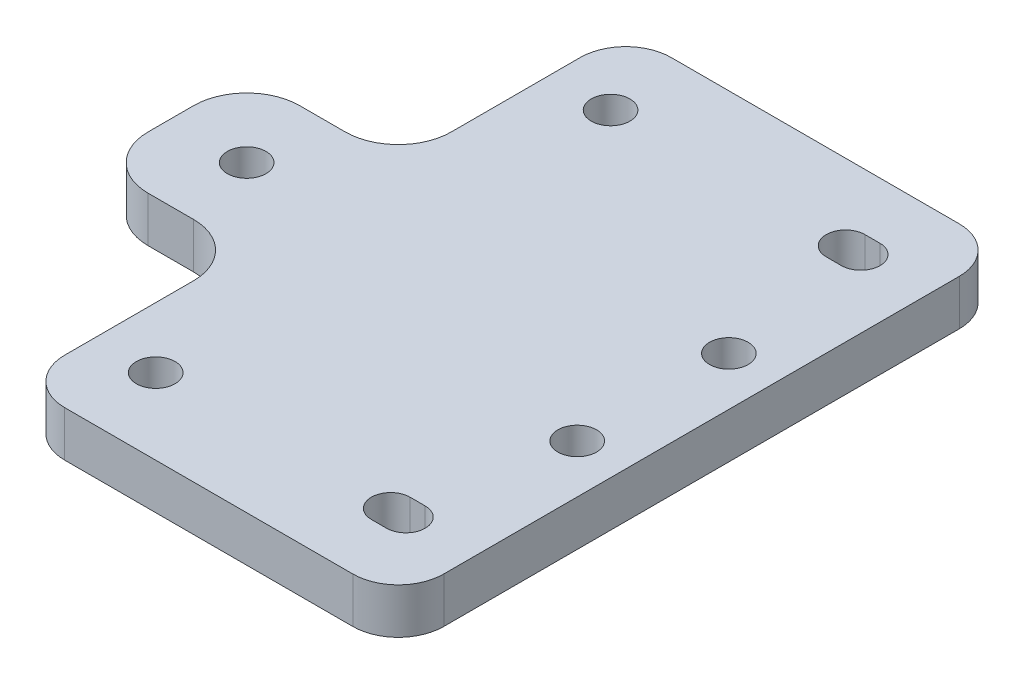
ISO-10303-21;
HEADER;
FILE_DESCRIPTION(('STEP AP214'),'2;1');
FILE_NAME('part.step','',(''),(''),'','','');
FILE_SCHEMA(('AUTOMOTIVE_DESIGN { 1 0 10303 214 1 1 1 1 }'));
ENDSEC;
DATA;
#1=APPLICATION_CONTEXT('core data for automotive mechanical design processes');
#2=APPLICATION_PROTOCOL_DEFINITION('international standard','automotive_design',2000,#1);
#3=PRODUCT_CONTEXT('',#1,'mechanical');
#4=PRODUCT('Part','Part','',(#3));
#5=PRODUCT_RELATED_PRODUCT_CATEGORY('part','',(#4));
#6=PRODUCT_DEFINITION_FORMATION('','',#4);
#7=PRODUCT_DEFINITION_CONTEXT('part definition',#1,'design');
#8=PRODUCT_DEFINITION('design','',#6,#7);
#9=PRODUCT_DEFINITION_SHAPE('','',#8);
#10=(LENGTH_UNIT() NAMED_UNIT(*) SI_UNIT(.MILLI.,.METRE.));
#11=(NAMED_UNIT(*) PLANE_ANGLE_UNIT() SI_UNIT($,.RADIAN.));
#12=(NAMED_UNIT(*) SI_UNIT($,.STERADIAN.) SOLID_ANGLE_UNIT());
#13=UNCERTAINTY_MEASURE_WITH_UNIT(LENGTH_MEASURE(1.E-05),#10,'distance_accuracy_value','');
#14=(GEOMETRIC_REPRESENTATION_CONTEXT(3) GLOBAL_UNCERTAINTY_ASSIGNED_CONTEXT((#13)) GLOBAL_UNIT_ASSIGNED_CONTEXT((#10,
#11,#12)) REPRESENTATION_CONTEXT('',''));
#15=CARTESIAN_POINT('',(0.,0.,0.));
#16=DIRECTION('',(0.,0.,1.));
#17=DIRECTION('',(1.,0.,0.));
#18=AXIS2_PLACEMENT_3D('',#15,#16,#17);
#19=CARTESIAN_POINT('',(19.,6.,-34.));
#20=DIRECTION('',(0.,-1.,0.));
#21=DIRECTION('',(0.,0.,-1.));
#22=AXIS2_PLACEMENT_3D('',#19,#20,#21);
#23=PLANE('',#22);
#24=CARTESIAN_POINT('',(-17.,6.,30.));
#25=DIRECTION('',(0.,-1.,0.));
#26=DIRECTION('',(0.,0.,1.));
#27=AXIS2_PLACEMENT_3D('',#24,#25,#26);
#28=CIRCLE('',#27,2.55);
#29=CARTESIAN_POINT('',(-17.,6.,32.55));
#30=VERTEX_POINT('',#29);
#31=EDGE_CURVE('E250',#30,#30,#28,.T.);
#32=ORIENTED_EDGE('',*,*,#31,.T.);
#33=EDGE_LOOP('',(#32));
#34=FACE_BOUND('',#33,.T.);
#35=DIRECTION('',(1.,0.,0.));
#36=VECTOR('',#35,1.);
#37=CARTESIAN_POINT('',(16.,6.,27.45));
#38=LINE('',#37,#36);
#39=CARTESIAN_POINT('',(14.,6.,27.45));
#40=VERTEX_POINT('',#39);
#41=CARTESIAN_POINT('',(16.,6.,27.45));
#42=VERTEX_POINT('',#41);
#43=EDGE_CURVE('E243',#40,#42,#38,.T.);
#44=ORIENTED_EDGE('',*,*,#43,.T.);
#45=CARTESIAN_POINT('',(16.,6.,30.));
#46=DIRECTION('',(0.,-1.,0.));
#47=DIRECTION('',(0.,0.,1.));
#48=AXIS2_PLACEMENT_3D('',#45,#46,#47);
#49=CIRCLE('',#48,2.55000000000001);
#50=CARTESIAN_POINT('',(16.,6.,32.55));
#51=VERTEX_POINT('',#50);
#52=EDGE_CURVE('E235',#42,#51,#49,.T.);
#53=ORIENTED_EDGE('',*,*,#52,.T.);
#54=DIRECTION('',(-1.,0.,0.));
#55=VECTOR('',#54,1.);
#56=CARTESIAN_POINT('',(16.,6.,32.55));
#57=LINE('',#56,#55);
#58=CARTESIAN_POINT('',(14.,6.,32.55));
#59=VERTEX_POINT('',#58);
#60=EDGE_CURVE('E238',#51,#59,#57,.T.);
#61=ORIENTED_EDGE('',*,*,#60,.T.);
#62=CARTESIAN_POINT('',(14.,6.,30.));
#63=DIRECTION('',(0.,-1.,0.));
#64=DIRECTION('',(0.,0.,1.));
#65=AXIS2_PLACEMENT_3D('',#62,#63,#64);
#66=CIRCLE('',#65,2.55000000000001);
#67=EDGE_CURVE('E48',#59,#40,#66,.T.);
#68=ORIENTED_EDGE('',*,*,#67,.T.);
#69=EDGE_LOOP('',(#44,#53,#61,#68));
#70=FACE_BOUND('',#69,.T.);
#71=DIRECTION('',(1.,0.,0.));
#72=VECTOR('',#71,1.);
#73=CARTESIAN_POINT('',(16.,6.,-32.55));
#74=LINE('',#73,#72);
#75=CARTESIAN_POINT('',(14.,6.,-32.55));
#76=VERTEX_POINT('',#75);
#77=CARTESIAN_POINT('',(16.,6.,-32.55));
#78=VERTEX_POINT('',#77);
#79=EDGE_CURVE('E206',#76,#78,#74,.T.);
#80=ORIENTED_EDGE('',*,*,#79,.T.);
#81=CARTESIAN_POINT('',(16.,6.,-30.));
#82=DIRECTION('',(0.,-1.,0.));
#83=DIRECTION('',(0.,0.,-1.));
#84=AXIS2_PLACEMENT_3D('',#81,#82,#83);
#85=CIRCLE('',#84,2.55000000000001);
#86=CARTESIAN_POINT('',(16.,6.,-27.45));
#87=VERTEX_POINT('',#86);
#88=EDGE_CURVE('E198',#78,#87,#85,.T.);
#89=ORIENTED_EDGE('',*,*,#88,.T.);
#90=DIRECTION('',(-1.,0.,0.));
#91=VECTOR('',#90,1.);
#92=CARTESIAN_POINT('',(16.,6.,-27.45));
#93=LINE('',#92,#91);
#94=CARTESIAN_POINT('',(14.,6.,-27.45));
#95=VERTEX_POINT('',#94);
#96=EDGE_CURVE('E209',#87,#95,#93,.T.);
#97=ORIENTED_EDGE('',*,*,#96,.T.);
#98=CARTESIAN_POINT('',(14.,6.,-30.));
#99=DIRECTION('',(0.,-1.,0.));
#100=DIRECTION('',(0.,0.,-1.));
#101=AXIS2_PLACEMENT_3D('',#98,#99,#100);
#102=CIRCLE('',#101,2.55000000000001);
#103=EDGE_CURVE('E56',#95,#76,#102,.T.);
#104=ORIENTED_EDGE('',*,*,#103,.T.);
#105=EDGE_LOOP('',(#80,#89,#97,#104));
#106=FACE_BOUND('',#105,.T.);
#107=CARTESIAN_POINT('',(-17.,6.,-30.));
#108=DIRECTION('',(0.,-1.,0.));
#109=DIRECTION('',(0.,0.,-1.));
#110=AXIS2_PLACEMENT_3D('',#107,#108,#109);
#111=CIRCLE('',#110,2.55);
#112=CARTESIAN_POINT('',(-17.,6.,-32.55));
#113=VERTEX_POINT('',#112);
#114=EDGE_CURVE('E270',#113,#113,#111,.T.);
#115=ORIENTED_EDGE('',*,*,#114,.T.);
#116=EDGE_LOOP('',(#115));
#117=FACE_BOUND('',#116,.T.);
#118=CARTESIAN_POINT('',(19.,6.,-34.));
#119=DIRECTION('',(0.,1.,0.));
#120=DIRECTION('',(0.,0.,-1.));
#121=AXIS2_PLACEMENT_3D('',#118,#119,#120);
#122=CIRCLE('',#121,6.);
#123=CARTESIAN_POINT('',(25.,6.,-34.));
#124=VERTEX_POINT('',#123);
#125=CARTESIAN_POINT('',(19.,6.,-40.));
#126=VERTEX_POINT('',#125);
#127=EDGE_CURVE('E294',#124,#126,#122,.T.);
#128=ORIENTED_EDGE('',*,*,#127,.T.);
#129=DIRECTION('',(-1.,0.,0.));
#130=VECTOR('',#129,1.);
#131=CARTESIAN_POINT('',(-19.,6.,-40.));
#132=LINE('',#131,#130);
#133=CARTESIAN_POINT('',(-19.,6.,-40.));
#134=VERTEX_POINT('',#133);
#135=EDGE_CURVE('E297',#126,#134,#132,.T.);
#136=ORIENTED_EDGE('',*,*,#135,.T.);
#137=CARTESIAN_POINT('',(-19.,6.,-34.));
#138=DIRECTION('',(0.,1.,0.));
#139=DIRECTION('',(0.,0.,-1.));
#140=AXIS2_PLACEMENT_3D('',#137,#138,#139);
#141=CIRCLE('',#140,6.);
#142=CARTESIAN_POINT('',(-25.,6.,-34.));
#143=VERTEX_POINT('',#142);
#144=EDGE_CURVE('E300',#134,#143,#141,.T.);
#145=ORIENTED_EDGE('',*,*,#144,.T.);
#146=DIRECTION('',(0.,0.,1.));
#147=VECTOR('',#146,1.);
#148=CARTESIAN_POINT('',(-25.,6.,-17.));
#149=LINE('',#148,#147);
#150=CARTESIAN_POINT('',(-25.,6.,-17.));
#151=VERTEX_POINT('',#150);
#152=EDGE_CURVE('E302',#143,#151,#149,.T.);
#153=ORIENTED_EDGE('',*,*,#152,.T.);
#154=CARTESIAN_POINT('',(-32.,6.,-17.));
#155=DIRECTION('',(0.,-1.,0.));
#156=DIRECTION('',(0.,0.,1.));
#157=AXIS2_PLACEMENT_3D('',#154,#155,#156);
#158=CIRCLE('',#157,7.);
#159=CARTESIAN_POINT('',(-32.,6.,-10.));
#160=VERTEX_POINT('',#159);
#161=EDGE_CURVE('E304',#151,#160,#158,.T.);
#162=ORIENTED_EDGE('',*,*,#161,.T.);
#163=DIRECTION('',(-1.,0.,0.));
#164=VECTOR('',#163,1.);
#165=CARTESIAN_POINT('',(-32.,6.,-10.));
#166=LINE('',#165,#164);
#167=CARTESIAN_POINT('',(-38.,6.,-10.));
#168=VERTEX_POINT('',#167);
#169=EDGE_CURVE('E306',#160,#168,#166,.T.);
#170=ORIENTED_EDGE('',*,*,#169,.T.);
#171=CARTESIAN_POINT('',(-38.,6.,-3.));
#172=DIRECTION('',(0.,1.,0.));
#173=DIRECTION('',(0.,0.,-1.));
#174=AXIS2_PLACEMENT_3D('',#171,#172,#173);
#175=CIRCLE('',#174,7.);
#176=CARTESIAN_POINT('',(-45.,6.,-3.));
#177=VERTEX_POINT('',#176);
#178=EDGE_CURVE('E308',#168,#177,#175,.T.);
#179=ORIENTED_EDGE('',*,*,#178,.T.);
#180=DIRECTION('',(0.,0.,1.));
#181=VECTOR('',#180,1.);
#182=CARTESIAN_POINT('',(-45.,6.,3.));
#183=LINE('',#182,#181);
#184=CARTESIAN_POINT('',(-45.,6.,3.));
#185=VERTEX_POINT('',#184);
#186=EDGE_CURVE('E310',#177,#185,#183,.T.);
#187=ORIENTED_EDGE('',*,*,#186,.T.);
#188=CARTESIAN_POINT('',(-38.,6.,3.));
#189=DIRECTION('',(0.,1.,0.));
#190=DIRECTION('',(0.,0.,-1.));
#191=AXIS2_PLACEMENT_3D('',#188,#189,#190);
#192=CIRCLE('',#191,7.);
#193=CARTESIAN_POINT('',(-38.,6.,10.));
#194=VERTEX_POINT('',#193);
#195=EDGE_CURVE('E312',#185,#194,#192,.T.);
#196=ORIENTED_EDGE('',*,*,#195,.T.);
#197=DIRECTION('',(1.,0.,0.));
#198=VECTOR('',#197,1.);
#199=CARTESIAN_POINT('',(-32.,6.,10.));
#200=LINE('',#199,#198);
#201=CARTESIAN_POINT('',(-32.,6.,10.));
#202=VERTEX_POINT('',#201);
#203=EDGE_CURVE('E314',#194,#202,#200,.T.);
#204=ORIENTED_EDGE('',*,*,#203,.T.);
#205=CARTESIAN_POINT('',(-32.,6.,17.));
#206=DIRECTION('',(0.,-1.,0.));
#207=DIRECTION('',(0.,0.,1.));
#208=AXIS2_PLACEMENT_3D('',#205,#206,#207);
#209=CIRCLE('',#208,7.);
#210=CARTESIAN_POINT('',(-25.,6.,17.));
#211=VERTEX_POINT('',#210);
#212=EDGE_CURVE('E316',#202,#211,#209,.T.);
#213=ORIENTED_EDGE('',*,*,#212,.T.);
#214=DIRECTION('',(0.,0.,1.));
#215=VECTOR('',#214,1.);
#216=CARTESIAN_POINT('',(-25.,6.,34.));
#217=LINE('',#216,#215);
#218=CARTESIAN_POINT('',(-25.,6.,34.));
#219=VERTEX_POINT('',#218);
#220=EDGE_CURVE('E318',#211,#219,#217,.T.);
#221=ORIENTED_EDGE('',*,*,#220,.T.);
#222=CARTESIAN_POINT('',(-19.,6.,34.));
#223=DIRECTION('',(0.,1.,0.));
#224=DIRECTION('',(0.,0.,-1.));
#225=AXIS2_PLACEMENT_3D('',#222,#223,#224);
#226=CIRCLE('',#225,6.);
#227=CARTESIAN_POINT('',(-19.,6.,40.));
#228=VERTEX_POINT('',#227);
#229=EDGE_CURVE('E320',#219,#228,#226,.T.);
#230=ORIENTED_EDGE('',*,*,#229,.T.);
#231=DIRECTION('',(1.,0.,0.));
#232=VECTOR('',#231,1.);
#233=CARTESIAN_POINT('',(-19.,6.,40.));
#234=LINE('',#233,#232);
#235=CARTESIAN_POINT('',(19.,6.,40.));
#236=VERTEX_POINT('',#235);
#237=EDGE_CURVE('E322',#228,#236,#234,.T.);
#238=ORIENTED_EDGE('',*,*,#237,.T.);
#239=CARTESIAN_POINT('',(19.,6.,34.));
#240=DIRECTION('',(0.,1.,0.));
#241=DIRECTION('',(0.,0.,1.));
#242=AXIS2_PLACEMENT_3D('',#239,#240,#241);
#243=CIRCLE('',#242,6.);
#244=CARTESIAN_POINT('',(25.,6.,34.));
#245=VERTEX_POINT('',#244);
#246=EDGE_CURVE('E324',#236,#245,#243,.T.);
#247=ORIENTED_EDGE('',*,*,#246,.T.);
#248=DIRECTION('',(0.,0.,-1.));
#249=VECTOR('',#248,1.);
#250=CARTESIAN_POINT('',(25.,6.,34.));
#251=LINE('',#250,#249);
#252=EDGE_CURVE('E326',#245,#124,#251,.T.);
#253=ORIENTED_EDGE('',*,*,#252,.T.);
#254=EDGE_LOOP('',(#128,#136,#145,#153,#162,#170,#179,#187,#196,#204,#213,#221,#230,#238,#247,#253));
#255=FACE_BOUND('',#254,.T.);
#256=CARTESIAN_POINT('',(18.6050000000063,6.,-9.99999999999283));
#257=DIRECTION('',(0.,1.,0.));
#258=DIRECTION('',(0.,0.,1.));
#259=AXIS2_PLACEMENT_3D('',#256,#257,#258);
#260=CIRCLE('',#259,2.55);
#261=CARTESIAN_POINT('',(18.6050000000063,6.,-7.44999999999283));
#262=VERTEX_POINT('',#261);
#263=EDGE_CURVE('E288',#262,#262,#260,.T.);
#264=ORIENTED_EDGE('',*,*,#263,.F.);
#265=EDGE_LOOP('',(#264));
#266=FACE_BOUND('',#265,.T.);
#267=CARTESIAN_POINT('',(-35.,6.,0.));
#268=DIRECTION('',(0.,1.,0.));
#269=DIRECTION('',(0.,0.,1.));
#270=AXIS2_PLACEMENT_3D('',#267,#268,#269);
#271=CIRCLE('',#270,2.55000000000001);
#272=CARTESIAN_POINT('',(-35.,6.,2.55000000000001));
#273=VERTEX_POINT('',#272);
#274=EDGE_CURVE('E282',#273,#273,#271,.T.);
#275=ORIENTED_EDGE('',*,*,#274,.F.);
#276=EDGE_LOOP('',(#275));
#277=FACE_BOUND('',#276,.T.);
#278=CARTESIAN_POINT('',(18.6050000000063,6.,9.9999999999928));
#279=DIRECTION('',(0.,1.,0.));
#280=DIRECTION('',(0.,0.,-1.));
#281=AXIS2_PLACEMENT_3D('',#278,#279,#280);
#282=CIRCLE('',#281,2.55);
#283=CARTESIAN_POINT('',(18.6050000000063,6.,7.4499999999928));
#284=VERTEX_POINT('',#283);
#285=EDGE_CURVE('E276',#284,#284,#282,.T.);
#286=ORIENTED_EDGE('',*,*,#285,.F.);
#287=EDGE_LOOP('',(#286));
#288=FACE_BOUND('',#287,.T.);
#289=ADVANCED_FACE('F33',(#34,#70,#106,#117,#255,#266,#277,#288),#23,.F.);
#290=CARTESIAN_POINT('',(19.,0.,-34.));
#291=DIRECTION('',(0.,-1.,0.));
#292=DIRECTION('',(0.,0.,-1.));
#293=AXIS2_PLACEMENT_3D('',#290,#291,#292);
#294=PLANE('',#293);
#295=CARTESIAN_POINT('',(-17.,0.,30.));
#296=DIRECTION('',(0.,-1.,0.));
#297=DIRECTION('',(0.,0.,1.));
#298=AXIS2_PLACEMENT_3D('',#295,#296,#297);
#299=CIRCLE('',#298,2.55);
#300=CARTESIAN_POINT('',(-17.,0.,32.55));
#301=VERTEX_POINT('',#300);
#302=EDGE_CURVE('E267',#301,#301,#299,.T.);
#303=ORIENTED_EDGE('',*,*,#302,.F.);
#304=EDGE_LOOP('',(#303));
#305=FACE_BOUND('',#304,.T.);
#306=CARTESIAN_POINT('',(16.,0.,30.));
#307=DIRECTION('',(0.,-1.,0.));
#308=DIRECTION('',(0.,0.,1.));
#309=AXIS2_PLACEMENT_3D('',#306,#307,#308);
#310=CIRCLE('',#309,2.55000000000001);
#311=CARTESIAN_POINT('',(16.,0.,27.45));
#312=VERTEX_POINT('',#311);
#313=CARTESIAN_POINT('',(16.,0.,32.55));
#314=VERTEX_POINT('',#313);
#315=EDGE_CURVE('E247',#312,#314,#310,.T.);
#316=ORIENTED_EDGE('',*,*,#315,.F.);
#317=DIRECTION('',(1.,0.,0.));
#318=VECTOR('',#317,1.);
#319=CARTESIAN_POINT('',(16.,0.,27.45));
#320=LINE('',#319,#318);
#321=CARTESIAN_POINT('',(14.,0.,27.45));
#322=VERTEX_POINT('',#321);
#323=EDGE_CURVE('E239',#322,#312,#320,.T.);
#324=ORIENTED_EDGE('',*,*,#323,.F.);
#325=CARTESIAN_POINT('',(14.,0.,30.));
#326=DIRECTION('',(0.,-1.,0.));
#327=DIRECTION('',(0.,0.,1.));
#328=AXIS2_PLACEMENT_3D('',#325,#326,#327);
#329=CIRCLE('',#328,2.55000000000001);
#330=CARTESIAN_POINT('',(14.,0.,32.55));
#331=VERTEX_POINT('',#330);
#332=EDGE_CURVE('E253',#331,#322,#329,.T.);
#333=ORIENTED_EDGE('',*,*,#332,.F.);
#334=DIRECTION('',(-1.,0.,0.));
#335=VECTOR('',#334,1.);
#336=CARTESIAN_POINT('',(16.,0.,32.55));
#337=LINE('',#336,#335);
#338=EDGE_CURVE('E249',#314,#331,#337,.T.);
#339=ORIENTED_EDGE('',*,*,#338,.F.);
#340=EDGE_LOOP('',(#316,#324,#333,#339));
#341=FACE_BOUND('',#340,.T.);
#342=CARTESIAN_POINT('',(16.,0.,-30.));
#343=DIRECTION('',(0.,-1.,0.));
#344=DIRECTION('',(0.,0.,-1.));
#345=AXIS2_PLACEMENT_3D('',#342,#343,#344);
#346=CIRCLE('',#345,2.55000000000001);
#347=CARTESIAN_POINT('',(16.,0.,-32.55));
#348=VERTEX_POINT('',#347);
#349=CARTESIAN_POINT('',(16.,0.,-27.45));
#350=VERTEX_POINT('',#349);
#351=EDGE_CURVE('E201',#348,#350,#346,.T.);
#352=ORIENTED_EDGE('',*,*,#351,.F.);
#353=DIRECTION('',(1.,0.,0.));
#354=VECTOR('',#353,1.);
#355=CARTESIAN_POINT('',(16.,0.,-32.55));
#356=LINE('',#355,#354);
#357=CARTESIAN_POINT('',(14.,0.,-32.55));
#358=VERTEX_POINT('',#357);
#359=EDGE_CURVE('E215',#358,#348,#356,.T.);
#360=ORIENTED_EDGE('',*,*,#359,.F.);
#361=CARTESIAN_POINT('',(14.,0.,-30.));
#362=DIRECTION('',(0.,-1.,0.));
#363=DIRECTION('',(0.,0.,-1.));
#364=AXIS2_PLACEMENT_3D('',#361,#362,#363);
#365=CIRCLE('',#364,2.55000000000001);
#366=CARTESIAN_POINT('',(14.,0.,-27.45));
#367=VERTEX_POINT('',#366);
#368=EDGE_CURVE('E218',#367,#358,#365,.T.);
#369=ORIENTED_EDGE('',*,*,#368,.F.);
#370=DIRECTION('',(-1.,0.,0.));
#371=VECTOR('',#370,1.);
#372=CARTESIAN_POINT('',(16.,0.,-27.45));
#373=LINE('',#372,#371);
#374=EDGE_CURVE('E224',#350,#367,#373,.T.);
#375=ORIENTED_EDGE('',*,*,#374,.F.);
#376=EDGE_LOOP('',(#352,#360,#369,#375));
#377=FACE_BOUND('',#376,.T.);
#378=CARTESIAN_POINT('',(-17.,0.,-30.));
#379=DIRECTION('',(0.,-1.,0.));
#380=DIRECTION('',(0.,0.,-1.));
#381=AXIS2_PLACEMENT_3D('',#378,#379,#380);
#382=CIRCLE('',#381,2.55);
#383=CARTESIAN_POINT('',(-17.,0.,-32.55));
#384=VERTEX_POINT('',#383);
#385=EDGE_CURVE('E231',#384,#384,#382,.T.);
#386=ORIENTED_EDGE('',*,*,#385,.F.);
#387=EDGE_LOOP('',(#386));
#388=FACE_BOUND('',#387,.T.);
#389=CARTESIAN_POINT('',(-35.,0.,0.));
#390=DIRECTION('',(0.,1.,0.));
#391=DIRECTION('',(0.,0.,1.));
#392=AXIS2_PLACEMENT_3D('',#389,#390,#391);
#393=CIRCLE('',#392,2.55000000000001);
#394=CARTESIAN_POINT('',(-35.,0.,2.55000000000001));
#395=VERTEX_POINT('',#394);
#396=EDGE_CURVE('E279',#395,#395,#393,.T.);
#397=ORIENTED_EDGE('',*,*,#396,.T.);
#398=EDGE_LOOP('',(#397));
#399=FACE_BOUND('',#398,.T.);
#400=CARTESIAN_POINT('',(19.,0.,-34.));
#401=DIRECTION('',(0.,1.,0.));
#402=DIRECTION('',(0.,0.,-1.));
#403=AXIS2_PLACEMENT_3D('',#400,#401,#402);
#404=CIRCLE('',#403,6.);
#405=CARTESIAN_POINT('',(25.,0.,-34.));
#406=VERTEX_POINT('',#405);
#407=CARTESIAN_POINT('',(19.,0.,-40.));
#408=VERTEX_POINT('',#407);
#409=EDGE_CURVE('E291',#406,#408,#404,.T.);
#410=ORIENTED_EDGE('',*,*,#409,.F.);
#411=DIRECTION('',(0.,0.,-1.));
#412=VECTOR('',#411,1.);
#413=CARTESIAN_POINT('',(25.,0.,34.));
#414=LINE('',#413,#412);
#415=CARTESIAN_POINT('',(25.,0.,34.));
#416=VERTEX_POINT('',#415);
#417=EDGE_CURVE('E298',#416,#406,#414,.T.);
#418=ORIENTED_EDGE('',*,*,#417,.F.);
#419=CARTESIAN_POINT('',(19.,0.,34.));
#420=DIRECTION('',(0.,1.,0.));
#421=DIRECTION('',(0.,0.,1.));
#422=AXIS2_PLACEMENT_3D('',#419,#420,#421);
#423=CIRCLE('',#422,6.);
#424=CARTESIAN_POINT('',(19.,0.,40.));
#425=VERTEX_POINT('',#424);
#426=EDGE_CURVE('E357',#425,#416,#423,.T.);
#427=ORIENTED_EDGE('',*,*,#426,.F.);
#428=DIRECTION('',(1.,0.,0.));
#429=VECTOR('',#428,1.);
#430=CARTESIAN_POINT('',(-19.,0.,40.));
#431=LINE('',#430,#429);
#432=CARTESIAN_POINT('',(-19.,0.,40.));
#433=VERTEX_POINT('',#432);
#434=EDGE_CURVE('E355',#433,#425,#431,.T.);
#435=ORIENTED_EDGE('',*,*,#434,.F.);
#436=CARTESIAN_POINT('',(-19.,0.,34.));
#437=DIRECTION('',(0.,1.,0.));
#438=DIRECTION('',(0.,0.,-1.));
#439=AXIS2_PLACEMENT_3D('',#436,#437,#438);
#440=CIRCLE('',#439,6.);
#441=CARTESIAN_POINT('',(-25.,0.,34.));
#442=VERTEX_POINT('',#441);
#443=EDGE_CURVE('E353',#442,#433,#440,.T.);
#444=ORIENTED_EDGE('',*,*,#443,.F.);
#445=DIRECTION('',(0.,0.,1.));
#446=VECTOR('',#445,1.);
#447=CARTESIAN_POINT('',(-25.,0.,34.));
#448=LINE('',#447,#446);
#449=CARTESIAN_POINT('',(-25.,0.,17.));
#450=VERTEX_POINT('',#449);
#451=EDGE_CURVE('E351',#450,#442,#448,.T.);
#452=ORIENTED_EDGE('',*,*,#451,.F.);
#453=CARTESIAN_POINT('',(-32.,0.,17.));
#454=DIRECTION('',(0.,-1.,0.));
#455=DIRECTION('',(0.,0.,1.));
#456=AXIS2_PLACEMENT_3D('',#453,#454,#455);
#457=CIRCLE('',#456,7.);
#458=CARTESIAN_POINT('',(-32.,0.,10.));
#459=VERTEX_POINT('',#458);
#460=EDGE_CURVE('E349',#459,#450,#457,.T.);
#461=ORIENTED_EDGE('',*,*,#460,.F.);
#462=DIRECTION('',(1.,0.,0.));
#463=VECTOR('',#462,1.);
#464=CARTESIAN_POINT('',(-32.,0.,10.));
#465=LINE('',#464,#463);
#466=CARTESIAN_POINT('',(-38.,0.,10.));
#467=VERTEX_POINT('',#466);
#468=EDGE_CURVE('E347',#467,#459,#465,.T.);
#469=ORIENTED_EDGE('',*,*,#468,.F.);
#470=CARTESIAN_POINT('',(-38.,0.,3.));
#471=DIRECTION('',(0.,1.,0.));
#472=DIRECTION('',(0.,0.,-1.));
#473=AXIS2_PLACEMENT_3D('',#470,#471,#472);
#474=CIRCLE('',#473,7.);
#475=CARTESIAN_POINT('',(-45.,0.,3.));
#476=VERTEX_POINT('',#475);
#477=EDGE_CURVE('E345',#476,#467,#474,.T.);
#478=ORIENTED_EDGE('',*,*,#477,.F.);
#479=DIRECTION('',(0.,0.,1.));
#480=VECTOR('',#479,1.);
#481=CARTESIAN_POINT('',(-45.,0.,3.));
#482=LINE('',#481,#480);
#483=CARTESIAN_POINT('',(-45.,0.,-3.));
#484=VERTEX_POINT('',#483);
#485=EDGE_CURVE('E343',#484,#476,#482,.T.);
#486=ORIENTED_EDGE('',*,*,#485,.F.);
#487=CARTESIAN_POINT('',(-38.,0.,-3.));
#488=DIRECTION('',(0.,1.,0.));
#489=DIRECTION('',(0.,0.,-1.));
#490=AXIS2_PLACEMENT_3D('',#487,#488,#489);
#491=CIRCLE('',#490,7.);
#492=CARTESIAN_POINT('',(-38.,0.,-10.));
#493=VERTEX_POINT('',#492);
#494=EDGE_CURVE('E341',#493,#484,#491,.T.);
#495=ORIENTED_EDGE('',*,*,#494,.F.);
#496=DIRECTION('',(-1.,0.,0.));
#497=VECTOR('',#496,1.);
#498=CARTESIAN_POINT('',(-32.,0.,-10.));
#499=LINE('',#498,#497);
#500=CARTESIAN_POINT('',(-32.,0.,-10.));
#501=VERTEX_POINT('',#500);
#502=EDGE_CURVE('E339',#501,#493,#499,.T.);
#503=ORIENTED_EDGE('',*,*,#502,.F.);
#504=CARTESIAN_POINT('',(-32.,0.,-17.));
#505=DIRECTION('',(0.,-1.,0.));
#506=DIRECTION('',(0.,0.,1.));
#507=AXIS2_PLACEMENT_3D('',#504,#505,#506);
#508=CIRCLE('',#507,7.);
#509=CARTESIAN_POINT('',(-25.,0.,-17.));
#510=VERTEX_POINT('',#509);
#511=EDGE_CURVE('E337',#510,#501,#508,.T.);
#512=ORIENTED_EDGE('',*,*,#511,.F.);
#513=DIRECTION('',(0.,0.,1.));
#514=VECTOR('',#513,1.);
#515=CARTESIAN_POINT('',(-25.,0.,-17.));
#516=LINE('',#515,#514);
#517=CARTESIAN_POINT('',(-25.,0.,-34.));
#518=VERTEX_POINT('',#517);
#519=EDGE_CURVE('E335',#518,#510,#516,.T.);
#520=ORIENTED_EDGE('',*,*,#519,.F.);
#521=CARTESIAN_POINT('',(-19.,0.,-34.));
#522=DIRECTION('',(0.,1.,0.));
#523=DIRECTION('',(0.,0.,-1.));
#524=AXIS2_PLACEMENT_3D('',#521,#522,#523);
#525=CIRCLE('',#524,6.);
#526=CARTESIAN_POINT('',(-19.,0.,-40.));
#527=VERTEX_POINT('',#526);
#528=EDGE_CURVE('E333',#527,#518,#525,.T.);
#529=ORIENTED_EDGE('',*,*,#528,.F.);
#530=DIRECTION('',(-1.,0.,0.));
#531=VECTOR('',#530,1.);
#532=CARTESIAN_POINT('',(-19.,0.,-40.));
#533=LINE('',#532,#531);
#534=EDGE_CURVE('E331',#408,#527,#533,.T.);
#535=ORIENTED_EDGE('',*,*,#534,.F.);
#536=EDGE_LOOP('',(#410,#418,#427,#435,#444,#452,#461,#469,#478,#486,#495,#503,#512,#520,#529,#535));
#537=FACE_BOUND('',#536,.T.);
#538=CARTESIAN_POINT('',(18.6050000000063,0.,-9.99999999999283));
#539=DIRECTION('',(0.,1.,0.));
#540=DIRECTION('',(0.,0.,1.));
#541=AXIS2_PLACEMENT_3D('',#538,#539,#540);
#542=CIRCLE('',#541,2.55);
#543=CARTESIAN_POINT('',(18.6050000000063,0.,-7.44999999999283));
#544=VERTEX_POINT('',#543);
#545=EDGE_CURVE('E285',#544,#544,#542,.T.);
#546=ORIENTED_EDGE('',*,*,#545,.T.);
#547=EDGE_LOOP('',(#546));
#548=FACE_BOUND('',#547,.T.);
#549=CARTESIAN_POINT('',(18.6050000000063,0.,9.9999999999928));
#550=DIRECTION('',(0.,1.,0.));
#551=DIRECTION('',(0.,0.,-1.));
#552=AXIS2_PLACEMENT_3D('',#549,#550,#551);
#553=CIRCLE('',#552,2.55);
#554=CARTESIAN_POINT('',(18.6050000000063,0.,7.4499999999928));
#555=VERTEX_POINT('',#554);
#556=EDGE_CURVE('E273',#555,#555,#553,.T.);
#557=ORIENTED_EDGE('',*,*,#556,.T.);
#558=EDGE_LOOP('',(#557));
#559=FACE_BOUND('',#558,.T.);
#560=ADVANCED_FACE('F411',(#305,#341,#377,#388,#399,#537,#548,#559),#294,.T.);
#561=CARTESIAN_POINT('',(19.,6.,-34.));
#562=DIRECTION('',(0.,-1.,0.));
#563=DIRECTION('',(0.,0.,-1.));
#564=AXIS2_PLACEMENT_3D('',#561,#562,#563);
#565=CYLINDRICAL_SURFACE('',#564,6.);
#566=ORIENTED_EDGE('',*,*,#409,.T.);
#567=DIRECTION('',(0.,-1.,0.));
#568=VECTOR('',#567,1.);
#569=CARTESIAN_POINT('',(19.,6.,-40.));
#570=LINE('',#569,#568);
#571=EDGE_CURVE('E11',#126,#408,#570,.T.);
#572=ORIENTED_EDGE('',*,*,#571,.F.);
#573=ORIENTED_EDGE('',*,*,#127,.F.);
#574=DIRECTION('',(0.,-1.,0.));
#575=VECTOR('',#574,1.);
#576=CARTESIAN_POINT('',(25.,6.,-34.));
#577=LINE('',#576,#575);
#578=EDGE_CURVE('E328',#124,#406,#577,.T.);
#579=ORIENTED_EDGE('',*,*,#578,.T.);
#580=EDGE_LOOP('',(#566,#572,#573,#579));
#581=FACE_BOUND('',#580,.T.);
#582=ADVANCED_FACE('F35',(#581),#565,.T.);
#583=CARTESIAN_POINT('',(-19.,6.,-40.));
#584=DIRECTION('',(0.,0.,1.));
#585=DIRECTION('',(1.,0.,0.));
#586=AXIS2_PLACEMENT_3D('',#583,#584,#585);
#587=PLANE('',#586);
#588=ORIENTED_EDGE('',*,*,#534,.T.);
#589=DIRECTION('',(0.,-1.,0.));
#590=VECTOR('',#589,1.);
#591=CARTESIAN_POINT('',(-19.,6.,-40.));
#592=LINE('',#591,#590);
#593=EDGE_CURVE('E41',#134,#527,#592,.T.);
#594=ORIENTED_EDGE('',*,*,#593,.F.);
#595=ORIENTED_EDGE('',*,*,#135,.F.);
#596=ORIENTED_EDGE('',*,*,#571,.T.);
#597=EDGE_LOOP('',(#588,#594,#595,#596));
#598=FACE_BOUND('',#597,.T.);
#599=ADVANCED_FACE('F429',(#598),#587,.F.);
#600=CARTESIAN_POINT('',(-19.,6.,-34.));
#601=DIRECTION('',(0.,-1.,0.));
#602=DIRECTION('',(0.,0.,-1.));
#603=AXIS2_PLACEMENT_3D('',#600,#601,#602);
#604=CYLINDRICAL_SURFACE('',#603,6.);
#605=ORIENTED_EDGE('',*,*,#528,.T.);
#606=DIRECTION('',(0.,-1.,0.));
#607=VECTOR('',#606,1.);
#608=CARTESIAN_POINT('',(-25.,6.,-34.));
#609=LINE('',#608,#607);
#610=EDGE_CURVE('E398',#143,#518,#609,.T.);
#611=ORIENTED_EDGE('',*,*,#610,.F.);
#612=ORIENTED_EDGE('',*,*,#144,.F.);
#613=ORIENTED_EDGE('',*,*,#593,.T.);
#614=EDGE_LOOP('',(#605,#611,#612,#613));
#615=FACE_BOUND('',#614,.T.);
#616=ADVANCED_FACE('F405',(#615),#604,.T.);
#617=CARTESIAN_POINT('',(-25.,6.,-17.));
#618=DIRECTION('',(1.,0.,0.));
#619=DIRECTION('',(0.,0.,-1.));
#620=AXIS2_PLACEMENT_3D('',#617,#618,#619);
#621=PLANE('',#620);
#622=ORIENTED_EDGE('',*,*,#519,.T.);
#623=DIRECTION('',(0.,-1.,0.));
#624=VECTOR('',#623,1.);
#625=CARTESIAN_POINT('',(-25.,6.,-17.));
#626=LINE('',#625,#624);
#627=EDGE_CURVE('E395',#151,#510,#626,.T.);
#628=ORIENTED_EDGE('',*,*,#627,.F.);
#629=ORIENTED_EDGE('',*,*,#152,.F.);
#630=ORIENTED_EDGE('',*,*,#610,.T.);
#631=EDGE_LOOP('',(#622,#628,#629,#630));
#632=FACE_BOUND('',#631,.T.);
#633=ADVANCED_FACE('F417',(#632),#621,.F.);
#634=CARTESIAN_POINT('',(-32.,6.,-17.));
#635=DIRECTION('',(0.,-1.,0.));
#636=DIRECTION('',(0.,0.,-1.));
#637=AXIS2_PLACEMENT_3D('',#634,#635,#636);
#638=CYLINDRICAL_SURFACE('',#637,7.);
#639=ORIENTED_EDGE('',*,*,#511,.T.);
#640=DIRECTION('',(0.,-1.,0.));
#641=VECTOR('',#640,1.);
#642=CARTESIAN_POINT('',(-32.,6.,-10.));
#643=LINE('',#642,#641);
#644=EDGE_CURVE('E392',#160,#501,#643,.T.);
#645=ORIENTED_EDGE('',*,*,#644,.F.);
#646=ORIENTED_EDGE('',*,*,#161,.F.);
#647=ORIENTED_EDGE('',*,*,#627,.T.);
#648=EDGE_LOOP('',(#639,#645,#646,#647));
#649=FACE_BOUND('',#648,.T.);
#650=ADVANCED_FACE('F421',(#649),#638,.F.);
#651=CARTESIAN_POINT('',(-32.,6.,-10.));
#652=DIRECTION('',(0.,0.,1.));
#653=DIRECTION('',(1.,0.,0.));
#654=AXIS2_PLACEMENT_3D('',#651,#652,#653);
#655=PLANE('',#654);
#656=ORIENTED_EDGE('',*,*,#502,.T.);
#657=DIRECTION('',(0.,-1.,0.));
#658=VECTOR('',#657,1.);
#659=CARTESIAN_POINT('',(-38.,6.,-10.));
#660=LINE('',#659,#658);
#661=EDGE_CURVE('E389',#168,#493,#660,.T.);
#662=ORIENTED_EDGE('',*,*,#661,.F.);
#663=ORIENTED_EDGE('',*,*,#169,.F.);
#664=ORIENTED_EDGE('',*,*,#644,.T.);
#665=EDGE_LOOP('',(#656,#662,#663,#664));
#666=FACE_BOUND('',#665,.T.);
#667=ADVANCED_FACE('F482',(#666),#655,.F.);
#668=CARTESIAN_POINT('',(-38.,6.,-3.));
#669=DIRECTION('',(0.,-1.,0.));
#670=DIRECTION('',(0.,0.,-1.));
#671=AXIS2_PLACEMENT_3D('',#668,#669,#670);
#672=CYLINDRICAL_SURFACE('',#671,7.);
#673=ORIENTED_EDGE('',*,*,#494,.T.);
#674=DIRECTION('',(0.,-1.,0.));
#675=VECTOR('',#674,1.);
#676=CARTESIAN_POINT('',(-45.,6.,-3.));
#677=LINE('',#676,#675);
#678=EDGE_CURVE('E386',#177,#484,#677,.T.);
#679=ORIENTED_EDGE('',*,*,#678,.F.);
#680=ORIENTED_EDGE('',*,*,#178,.F.);
#681=ORIENTED_EDGE('',*,*,#661,.T.);
#682=EDGE_LOOP('',(#673,#679,#680,#681));
#683=FACE_BOUND('',#682,.T.);
#684=ADVANCED_FACE('F479',(#683),#672,.T.);
#685=CARTESIAN_POINT('',(-45.,6.,3.));
#686=DIRECTION('',(1.,0.,0.));
#687=DIRECTION('',(0.,0.,-1.));
#688=AXIS2_PLACEMENT_3D('',#685,#686,#687);
#689=PLANE('',#688);
#690=ORIENTED_EDGE('',*,*,#485,.T.);
#691=DIRECTION('',(0.,-1.,0.));
#692=VECTOR('',#691,1.);
#693=CARTESIAN_POINT('',(-45.,6.,3.));
#694=LINE('',#693,#692);
#695=EDGE_CURVE('E383',#185,#476,#694,.T.);
#696=ORIENTED_EDGE('',*,*,#695,.F.);
#697=ORIENTED_EDGE('',*,*,#186,.F.);
#698=ORIENTED_EDGE('',*,*,#678,.T.);
#699=EDGE_LOOP('',(#690,#696,#697,#698));
#700=FACE_BOUND('',#699,.T.);
#701=ADVANCED_FACE('F475',(#700),#689,.F.);
#702=CARTESIAN_POINT('',(-38.,6.,3.));
#703=DIRECTION('',(0.,-1.,0.));
#704=DIRECTION('',(0.,0.,-1.));
#705=AXIS2_PLACEMENT_3D('',#702,#703,#704);
#706=CYLINDRICAL_SURFACE('',#705,7.);
#707=ORIENTED_EDGE('',*,*,#477,.T.);
#708=DIRECTION('',(0.,-1.,0.));
#709=VECTOR('',#708,1.);
#710=CARTESIAN_POINT('',(-38.,6.,10.));
#711=LINE('',#710,#709);
#712=EDGE_CURVE('E380',#194,#467,#711,.T.);
#713=ORIENTED_EDGE('',*,*,#712,.F.);
#714=ORIENTED_EDGE('',*,*,#195,.F.);
#715=ORIENTED_EDGE('',*,*,#695,.T.);
#716=EDGE_LOOP('',(#707,#713,#714,#715));
#717=FACE_BOUND('',#716,.T.);
#718=ADVANCED_FACE('F471',(#717),#706,.T.);
#719=CARTESIAN_POINT('',(-32.,6.,10.));
#720=DIRECTION('',(0.,0.,-1.));
#721=DIRECTION('',(-1.,0.,0.));
#722=AXIS2_PLACEMENT_3D('',#719,#720,#721);
#723=PLANE('',#722);
#724=ORIENTED_EDGE('',*,*,#468,.T.);
#725=DIRECTION('',(0.,-1.,0.));
#726=VECTOR('',#725,1.);
#727=CARTESIAN_POINT('',(-32.,6.,10.));
#728=LINE('',#727,#726);
#729=EDGE_CURVE('E377',#202,#459,#728,.T.);
#730=ORIENTED_EDGE('',*,*,#729,.F.);
#731=ORIENTED_EDGE('',*,*,#203,.F.);
#732=ORIENTED_EDGE('',*,*,#712,.T.);
#733=EDGE_LOOP('',(#724,#730,#731,#732));
#734=FACE_BOUND('',#733,.T.);
#735=ADVANCED_FACE('F466',(#734),#723,.F.);
#736=CARTESIAN_POINT('',(-32.,6.,17.));
#737=DIRECTION('',(0.,-1.,0.));
#738=DIRECTION('',(0.,0.,-1.));
#739=AXIS2_PLACEMENT_3D('',#736,#737,#738);
#740=CYLINDRICAL_SURFACE('',#739,7.);
#741=ORIENTED_EDGE('',*,*,#460,.T.);
#742=DIRECTION('',(0.,-1.,0.));
#743=VECTOR('',#742,1.);
#744=CARTESIAN_POINT('',(-25.,6.,17.));
#745=LINE('',#744,#743);
#746=EDGE_CURVE('E374',#211,#450,#745,.T.);
#747=ORIENTED_EDGE('',*,*,#746,.F.);
#748=ORIENTED_EDGE('',*,*,#212,.F.);
#749=ORIENTED_EDGE('',*,*,#729,.T.);
#750=EDGE_LOOP('',(#741,#747,#748,#749));
#751=FACE_BOUND('',#750,.T.);
#752=ADVANCED_FACE('F460',(#751),#740,.F.);
#753=CARTESIAN_POINT('',(-25.,6.,34.));
#754=DIRECTION('',(1.,0.,0.));
#755=DIRECTION('',(0.,0.,-1.));
#756=AXIS2_PLACEMENT_3D('',#753,#754,#755);
#757=PLANE('',#756);
#758=ORIENTED_EDGE('',*,*,#451,.T.);
#759=DIRECTION('',(0.,-1.,0.));
#760=VECTOR('',#759,1.);
#761=CARTESIAN_POINT('',(-25.,6.,34.));
#762=LINE('',#761,#760);
#763=EDGE_CURVE('E371',#219,#442,#762,.T.);
#764=ORIENTED_EDGE('',*,*,#763,.F.);
#765=ORIENTED_EDGE('',*,*,#220,.F.);
#766=ORIENTED_EDGE('',*,*,#746,.T.);
#767=EDGE_LOOP('',(#758,#764,#765,#766));
#768=FACE_BOUND('',#767,.T.);
#769=ADVANCED_FACE('F456',(#768),#757,.F.);
#770=CARTESIAN_POINT('',(-19.,6.,34.));
#771=DIRECTION('',(0.,-1.,0.));
#772=DIRECTION('',(0.,0.,-1.));
#773=AXIS2_PLACEMENT_3D('',#770,#771,#772);
#774=CYLINDRICAL_SURFACE('',#773,6.);
#775=ORIENTED_EDGE('',*,*,#443,.T.);
#776=DIRECTION('',(0.,-1.,0.));
#777=VECTOR('',#776,1.);
#778=CARTESIAN_POINT('',(-19.,6.,40.));
#779=LINE('',#778,#777);
#780=EDGE_CURVE('E368',#228,#433,#779,.T.);
#781=ORIENTED_EDGE('',*,*,#780,.F.);
#782=ORIENTED_EDGE('',*,*,#229,.F.);
#783=ORIENTED_EDGE('',*,*,#763,.T.);
#784=EDGE_LOOP('',(#775,#781,#782,#783));
#785=FACE_BOUND('',#784,.T.);
#786=ADVANCED_FACE('F451',(#785),#774,.T.);
#787=CARTESIAN_POINT('',(-19.,6.,40.));
#788=DIRECTION('',(0.,0.,-1.));
#789=DIRECTION('',(-1.,0.,0.));
#790=AXIS2_PLACEMENT_3D('',#787,#788,#789);
#791=PLANE('',#790);
#792=ORIENTED_EDGE('',*,*,#434,.T.);
#793=DIRECTION('',(0.,-1.,0.));
#794=VECTOR('',#793,1.);
#795=CARTESIAN_POINT('',(19.,6.,40.));
#796=LINE('',#795,#794);
#797=EDGE_CURVE('E365',#236,#425,#796,.T.);
#798=ORIENTED_EDGE('',*,*,#797,.F.);
#799=ORIENTED_EDGE('',*,*,#237,.F.);
#800=ORIENTED_EDGE('',*,*,#780,.T.);
#801=EDGE_LOOP('',(#792,#798,#799,#800));
#802=FACE_BOUND('',#801,.T.);
#803=ADVANCED_FACE('F445',(#802),#791,.F.);
#804=CARTESIAN_POINT('',(19.,6.,34.));
#805=DIRECTION('',(0.,-1.,0.));
#806=DIRECTION('',(0.,0.,-1.));
#807=AXIS2_PLACEMENT_3D('',#804,#805,#806);
#808=CYLINDRICAL_SURFACE('',#807,6.);
#809=ORIENTED_EDGE('',*,*,#426,.T.);
#810=DIRECTION('',(0.,-1.,0.));
#811=VECTOR('',#810,1.);
#812=CARTESIAN_POINT('',(25.,6.,34.));
#813=LINE('',#812,#811);
#814=EDGE_CURVE('E362',#245,#416,#813,.T.);
#815=ORIENTED_EDGE('',*,*,#814,.F.);
#816=ORIENTED_EDGE('',*,*,#246,.F.);
#817=ORIENTED_EDGE('',*,*,#797,.T.);
#818=EDGE_LOOP('',(#809,#815,#816,#817));
#819=FACE_BOUND('',#818,.T.);
#820=ADVANCED_FACE('F441',(#819),#808,.T.);
#821=CARTESIAN_POINT('',(25.,6.,34.));
#822=DIRECTION('',(-1.,0.,0.));
#823=DIRECTION('',(0.,0.,1.));
#824=AXIS2_PLACEMENT_3D('',#821,#822,#823);
#825=PLANE('',#824);
#826=ORIENTED_EDGE('',*,*,#417,.T.);
#827=ORIENTED_EDGE('',*,*,#578,.F.);
#828=ORIENTED_EDGE('',*,*,#252,.F.);
#829=ORIENTED_EDGE('',*,*,#814,.T.);
#830=EDGE_LOOP('',(#826,#827,#828,#829));
#831=FACE_BOUND('',#830,.T.);
#832=ADVANCED_FACE('F436',(#831),#825,.F.);
#833=CARTESIAN_POINT('',(18.6050000000063,6.,-9.99999999999283));
#834=DIRECTION('',(0.,-1.,0.));
#835=DIRECTION('',(0.,0.,-1.));
#836=AXIS2_PLACEMENT_3D('',#833,#834,#835);
#837=CYLINDRICAL_SURFACE('',#836,2.55);
#838=ORIENTED_EDGE('',*,*,#263,.T.);
#839=EDGE_LOOP('',(#838));
#840=FACE_BOUND('',#839,.T.);
#841=ORIENTED_EDGE('',*,*,#545,.F.);
#842=EDGE_LOOP('',(#841));
#843=FACE_BOUND('',#842,.T.);
#844=ADVANCED_FACE('F501',(#840,#843),#837,.F.);
#845=CARTESIAN_POINT('',(-35.,6.,0.));
#846=DIRECTION('',(0.,-1.,0.));
#847=DIRECTION('',(0.,0.,-1.));
#848=AXIS2_PLACEMENT_3D('',#845,#846,#847);
#849=CYLINDRICAL_SURFACE('',#848,2.55000000000001);
#850=ORIENTED_EDGE('',*,*,#274,.T.);
#851=EDGE_LOOP('',(#850));
#852=FACE_BOUND('',#851,.T.);
#853=ORIENTED_EDGE('',*,*,#396,.F.);
#854=EDGE_LOOP('',(#853));
#855=FACE_BOUND('',#854,.T.);
#856=ADVANCED_FACE('F563',(#852,#855),#849,.F.);
#857=CARTESIAN_POINT('',(18.6050000000063,6.,9.9999999999928));
#858=DIRECTION('',(0.,-1.,0.));
#859=DIRECTION('',(0.,0.,-1.));
#860=AXIS2_PLACEMENT_3D('',#857,#858,#859);
#861=CYLINDRICAL_SURFACE('',#860,2.55);
#862=ORIENTED_EDGE('',*,*,#285,.T.);
#863=EDGE_LOOP('',(#862));
#864=FACE_BOUND('',#863,.T.);
#865=ORIENTED_EDGE('',*,*,#556,.F.);
#866=EDGE_LOOP('',(#865));
#867=FACE_BOUND('',#866,.T.);
#868=ADVANCED_FACE('F570',(#864,#867),#861,.F.);
#869=CARTESIAN_POINT('',(-17.,6.,-30.));
#870=DIRECTION('',(0.,-1.,0.));
#871=DIRECTION('',(0.,0.,-1.));
#872=AXIS2_PLACEMENT_3D('',#869,#870,#871);
#873=CYLINDRICAL_SURFACE('',#872,2.55);
#874=ORIENTED_EDGE('',*,*,#114,.F.);
#875=EDGE_LOOP('',(#874));
#876=FACE_BOUND('',#875,.T.);
#877=ORIENTED_EDGE('',*,*,#385,.T.);
#878=EDGE_LOOP('',(#877));
#879=FACE_BOUND('',#878,.T.);
#880=ADVANCED_FACE('F577',(#876,#879),#873,.F.);
#881=CARTESIAN_POINT('',(16.,6.,-30.));
#882=DIRECTION('',(0.,-1.,0.));
#883=DIRECTION('',(0.,0.,-1.));
#884=AXIS2_PLACEMENT_3D('',#881,#882,#883);
#885=CYLINDRICAL_SURFACE('',#884,2.55000000000001);
#886=ORIENTED_EDGE('',*,*,#351,.T.);
#887=DIRECTION('',(0.,-1.,0.));
#888=VECTOR('',#887,1.);
#889=CARTESIAN_POINT('',(16.,6.,-27.45));
#890=LINE('',#889,#888);
#891=EDGE_CURVE('E194',#87,#350,#890,.T.);
#892=ORIENTED_EDGE('',*,*,#891,.F.);
#893=ORIENTED_EDGE('',*,*,#88,.F.);
#894=DIRECTION('',(0.,-1.,0.));
#895=VECTOR('',#894,1.);
#896=CARTESIAN_POINT('',(16.,6.,-32.55));
#897=LINE('',#896,#895);
#898=EDGE_CURVE('E229',#78,#348,#897,.T.);
#899=ORIENTED_EDGE('',*,*,#898,.T.);
#900=EDGE_LOOP('',(#886,#892,#893,#899));
#901=FACE_BOUND('',#900,.T.);
#902=ADVANCED_FACE('F196',(#901),#885,.F.);
#903=CARTESIAN_POINT('',(16.,6.,-32.55));
#904=DIRECTION('',(0.,0.,-1.));
#905=DIRECTION('',(-1.,0.,0.));
#906=AXIS2_PLACEMENT_3D('',#903,#904,#905);
#907=PLANE('',#906);
#908=ORIENTED_EDGE('',*,*,#359,.T.);
#909=ORIENTED_EDGE('',*,*,#898,.F.);
#910=ORIENTED_EDGE('',*,*,#79,.F.);
#911=DIRECTION('',(0.,-1.,0.));
#912=VECTOR('',#911,1.);
#913=CARTESIAN_POINT('',(14.,6.,-32.55));
#914=LINE('',#913,#912);
#915=EDGE_CURVE('E232',#76,#358,#914,.T.);
#916=ORIENTED_EDGE('',*,*,#915,.T.);
#917=EDGE_LOOP('',(#908,#909,#910,#916));
#918=FACE_BOUND('',#917,.T.);
#919=ADVANCED_FACE('F593',(#918),#907,.F.);
#920=CARTESIAN_POINT('',(14.,6.,-30.));
#921=DIRECTION('',(0.,-1.,0.));
#922=DIRECTION('',(0.,0.,-1.));
#923=AXIS2_PLACEMENT_3D('',#920,#921,#922);
#924=CYLINDRICAL_SURFACE('',#923,2.55000000000001);
#925=ORIENTED_EDGE('',*,*,#368,.T.);
#926=ORIENTED_EDGE('',*,*,#915,.F.);
#927=ORIENTED_EDGE('',*,*,#103,.F.);
#928=DIRECTION('',(0.,-1.,0.));
#929=VECTOR('',#928,1.);
#930=CARTESIAN_POINT('',(14.,6.,-27.45));
#931=LINE('',#930,#929);
#932=EDGE_CURVE('E205',#95,#367,#931,.T.);
#933=ORIENTED_EDGE('',*,*,#932,.T.);
#934=EDGE_LOOP('',(#925,#926,#927,#933));
#935=FACE_BOUND('',#934,.T.);
#936=ADVANCED_FACE('F600',(#935),#924,.F.);
#937=CARTESIAN_POINT('',(16.,6.,-27.45));
#938=DIRECTION('',(0.,0.,1.));
#939=DIRECTION('',(1.,0.,0.));
#940=AXIS2_PLACEMENT_3D('',#937,#938,#939);
#941=PLANE('',#940);
#942=ORIENTED_EDGE('',*,*,#374,.T.);
#943=ORIENTED_EDGE('',*,*,#932,.F.);
#944=ORIENTED_EDGE('',*,*,#96,.F.);
#945=ORIENTED_EDGE('',*,*,#891,.T.);
#946=EDGE_LOOP('',(#942,#943,#944,#945));
#947=FACE_BOUND('',#946,.T.);
#948=ADVANCED_FACE('F210',(#947),#941,.F.);
#949=CARTESIAN_POINT('',(16.,6.,30.));
#950=DIRECTION('',(0.,-1.,0.));
#951=DIRECTION('',(0.,0.,-1.));
#952=AXIS2_PLACEMENT_3D('',#949,#950,#951);
#953=CYLINDRICAL_SURFACE('',#952,2.55000000000001);
#954=ORIENTED_EDGE('',*,*,#315,.T.);
#955=DIRECTION('',(0.,-1.,0.));
#956=VECTOR('',#955,1.);
#957=CARTESIAN_POINT('',(16.,6.,32.55));
#958=LINE('',#957,#956);
#959=EDGE_CURVE('E246',#51,#314,#958,.T.);
#960=ORIENTED_EDGE('',*,*,#959,.F.);
#961=ORIENTED_EDGE('',*,*,#52,.F.);
#962=DIRECTION('',(0.,-1.,0.));
#963=VECTOR('',#962,1.);
#964=CARTESIAN_POINT('',(16.,6.,27.45));
#965=LINE('',#964,#963);
#966=EDGE_CURVE('E225',#42,#312,#965,.T.);
#967=ORIENTED_EDGE('',*,*,#966,.T.);
#968=EDGE_LOOP('',(#954,#960,#961,#967));
#969=FACE_BOUND('',#968,.T.);
#970=ADVANCED_FACE('F614',(#969),#953,.F.);
#971=CARTESIAN_POINT('',(16.,6.,27.45));
#972=DIRECTION('',(0.,0.,-1.));
#973=DIRECTION('',(-1.,0.,0.));
#974=AXIS2_PLACEMENT_3D('',#971,#972,#973);
#975=PLANE('',#974);
#976=ORIENTED_EDGE('',*,*,#323,.T.);
#977=ORIENTED_EDGE('',*,*,#966,.F.);
#978=ORIENTED_EDGE('',*,*,#43,.F.);
#979=DIRECTION('',(0.,-1.,0.));
#980=VECTOR('',#979,1.);
#981=CARTESIAN_POINT('',(14.,6.,27.45));
#982=LINE('',#981,#980);
#983=EDGE_CURVE('E259',#40,#322,#982,.T.);
#984=ORIENTED_EDGE('',*,*,#983,.T.);
#985=EDGE_LOOP('',(#976,#977,#978,#984));
#986=FACE_BOUND('',#985,.T.);
#987=ADVANCED_FACE('F621',(#986),#975,.F.);
#988=CARTESIAN_POINT('',(14.,6.,30.));
#989=DIRECTION('',(0.,-1.,0.));
#990=DIRECTION('',(0.,0.,-1.));
#991=AXIS2_PLACEMENT_3D('',#988,#989,#990);
#992=CYLINDRICAL_SURFACE('',#991,2.55000000000001);
#993=ORIENTED_EDGE('',*,*,#332,.T.);
#994=ORIENTED_EDGE('',*,*,#983,.F.);
#995=ORIENTED_EDGE('',*,*,#67,.F.);
#996=DIRECTION('',(0.,-1.,0.));
#997=VECTOR('',#996,1.);
#998=CARTESIAN_POINT('',(14.,6.,32.55));
#999=LINE('',#998,#997);
#1000=EDGE_CURVE('E261',#59,#331,#999,.T.);
#1001=ORIENTED_EDGE('',*,*,#1000,.T.);
#1002=EDGE_LOOP('',(#993,#994,#995,#1001));
#1003=FACE_BOUND('',#1002,.T.);
#1004=ADVANCED_FACE('F629',(#1003),#992,.F.);
#1005=CARTESIAN_POINT('',(16.,6.,32.55));
#1006=DIRECTION('',(0.,0.,1.));
#1007=DIRECTION('',(1.,0.,0.));
#1008=AXIS2_PLACEMENT_3D('',#1005,#1006,#1007);
#1009=PLANE('',#1008);
#1010=ORIENTED_EDGE('',*,*,#338,.T.);
#1011=ORIENTED_EDGE('',*,*,#1000,.F.);
#1012=ORIENTED_EDGE('',*,*,#60,.F.);
#1013=ORIENTED_EDGE('',*,*,#959,.T.);
#1014=EDGE_LOOP('',(#1010,#1011,#1012,#1013));
#1015=FACE_BOUND('',#1014,.T.);
#1016=ADVANCED_FACE('F637',(#1015),#1009,.F.);
#1017=CARTESIAN_POINT('',(-17.,6.,30.));
#1018=DIRECTION('',(0.,-1.,0.));
#1019=DIRECTION('',(0.,0.,-1.));
#1020=AXIS2_PLACEMENT_3D('',#1017,#1018,#1019);
#1021=CYLINDRICAL_SURFACE('',#1020,2.55);
#1022=ORIENTED_EDGE('',*,*,#31,.F.);
#1023=EDGE_LOOP('',(#1022));
#1024=FACE_BOUND('',#1023,.T.);
#1025=ORIENTED_EDGE('',*,*,#302,.T.);
#1026=EDGE_LOOP('',(#1025));
#1027=FACE_BOUND('',#1026,.T.);
#1028=ADVANCED_FACE('F644',(#1024,#1027),#1021,.F.);
#1029=CLOSED_SHELL('',(#289,#560,#582,#599,#616,#633,#650,#667,#684,#701,#718,#735,#752,#769,
#786,#803,#820,#832,#844,#856,#868,#880,#902,#919,#936,#948,#970,#987,#1004,#1016,#1028));
#1030=MANIFOLD_SOLID_BREP('B2',#1029);
#1031=ADVANCED_BREP_SHAPE_REPRESENTATION('',(#18,#1030),#14);
#1032=SHAPE_DEFINITION_REPRESENTATION(#9,#1031);
ENDSEC;
END-ISO-10303-21;
